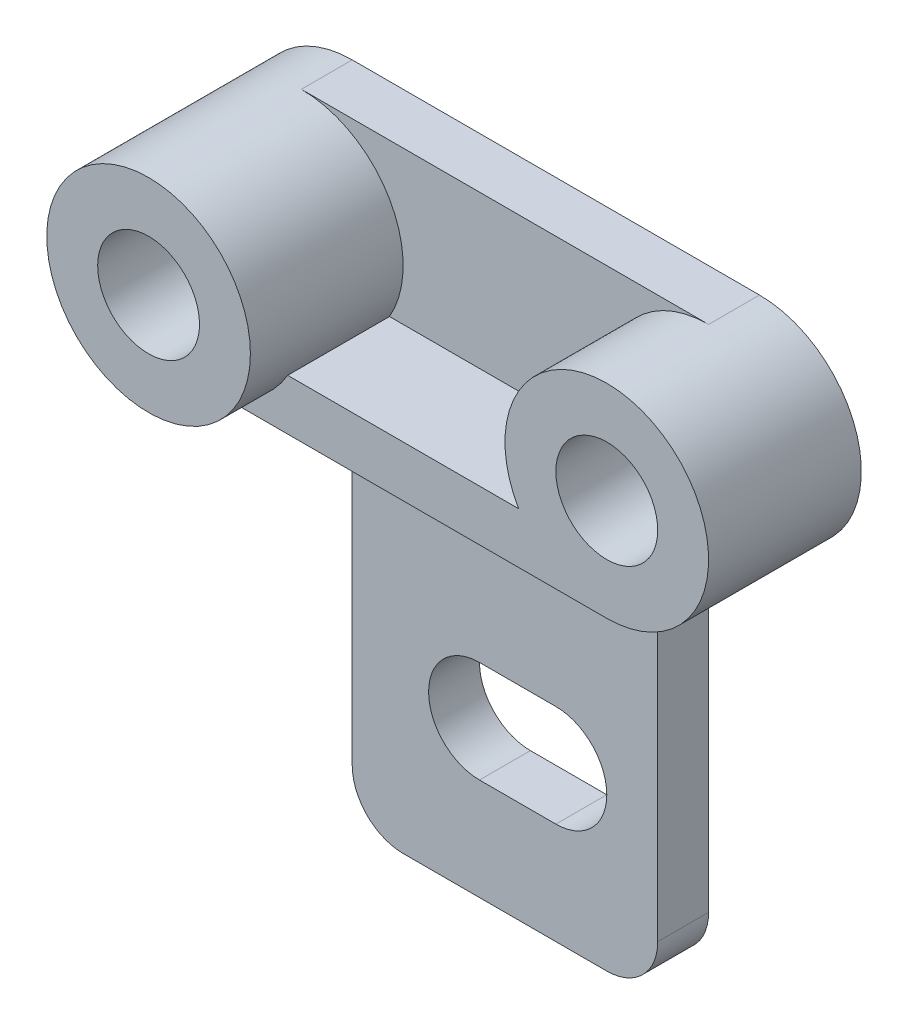
ISO-10303-21;
HEADER;
FILE_DESCRIPTION(('STEP AP214'),'2;1');
FILE_NAME('part.step','',(''),(''),'','','');
FILE_SCHEMA(('AUTOMOTIVE_DESIGN { 1 0 10303 214 1 1 1 1 }'));
ENDSEC;
DATA;
#1=APPLICATION_CONTEXT('core data for automotive mechanical design processes');
#2=APPLICATION_PROTOCOL_DEFINITION('international standard','automotive_design',2000,#1);
#3=PRODUCT_CONTEXT('',#1,'mechanical');
#4=PRODUCT('Part','Part','',(#3));
#5=PRODUCT_RELATED_PRODUCT_CATEGORY('part','',(#4));
#6=PRODUCT_DEFINITION_FORMATION('','',#4);
#7=PRODUCT_DEFINITION_CONTEXT('part definition',#1,'design');
#8=PRODUCT_DEFINITION('design','',#6,#7);
#9=PRODUCT_DEFINITION_SHAPE('','',#8);
#10=(LENGTH_UNIT() NAMED_UNIT(*) SI_UNIT(.MILLI.,.METRE.));
#11=(NAMED_UNIT(*) PLANE_ANGLE_UNIT() SI_UNIT($,.RADIAN.));
#12=(NAMED_UNIT(*) SI_UNIT($,.STERADIAN.) SOLID_ANGLE_UNIT());
#13=UNCERTAINTY_MEASURE_WITH_UNIT(LENGTH_MEASURE(1.E-05),#10,'distance_accuracy_value','');
#14=(GEOMETRIC_REPRESENTATION_CONTEXT(3) GLOBAL_UNCERTAINTY_ASSIGNED_CONTEXT((#13)) GLOBAL_UNIT_ASSIGNED_CONTEXT((#10,
#11,#12)) REPRESENTATION_CONTEXT('',''));
#15=CARTESIAN_POINT('',(0.,0.,0.));
#16=DIRECTION('',(0.,0.,1.));
#17=DIRECTION('',(1.,0.,0.));
#18=AXIS2_PLACEMENT_3D('',#15,#16,#17);
#19=CARTESIAN_POINT('',(-40.,3.00048960761197,40.));
#20=DIRECTION('',(0.,0.,1.));
#21=DIRECTION('',(1.,0.,0.));
#22=AXIS2_PLACEMENT_3D('',#19,#20,#21);
#23=PLANE('',#22);
#24=CARTESIAN_POINT('',(-40.,3.00048960761197,40.));
#25=DIRECTION('',(0.,0.,1.));
#26=DIRECTION('',(1.,0.,0.));
#27=AXIS2_PLACEMENT_3D('',#24,#25,#26);
#28=CIRCLE('',#27,20.);
#29=CARTESIAN_POINT('',(-20.,3.00048960761197,40.));
#30=VERTEX_POINT('',#29);
#31=EDGE_CURVE('E287',#30,#30,#28,.T.);
#32=ORIENTED_EDGE('',*,*,#31,.T.);
#33=EDGE_LOOP('',(#32));
#34=FACE_BOUND('',#33,.T.);
#35=CARTESIAN_POINT('',(-40.,3.00048960761197,40.));
#36=DIRECTION('',(0.,0.,-1.));
#37=DIRECTION('',(-1.,0.,0.));
#38=AXIS2_PLACEMENT_3D('',#35,#36,#37);
#39=CIRCLE('',#38,9.99999993899999);
#40=CARTESIAN_POINT('',(-49.999999939,3.00048960761197,40.));
#41=VERTEX_POINT('',#40);
#42=EDGE_CURVE('E187',#41,#41,#39,.T.);
#43=ORIENTED_EDGE('',*,*,#42,.T.);
#44=EDGE_LOOP('',(#43));
#45=FACE_BOUND('',#44,.T.);
#46=ADVANCED_FACE('F45',(#34,#45),#23,.T.);
#47=CARTESIAN_POINT('',(40.,3.00048960761197,0.));
#48=DIRECTION('',(0.,0.,1.));
#49=DIRECTION('',(1.,0.,0.));
#50=AXIS2_PLACEMENT_3D('',#47,#48,#49);
#51=PLANE('',#50);
#52=CARTESIAN_POINT('',(40.,3.00048960761197,0.));
#53=DIRECTION('',(0.,0.,-1.));
#54=DIRECTION('',(-1.,0.,0.));
#55=AXIS2_PLACEMENT_3D('',#52,#53,#54);
#56=CIRCLE('',#55,9.999999939);
#57=CARTESIAN_POINT('',(30.000000061,3.00048960761197,0.));
#58=VERTEX_POINT('',#57);
#59=EDGE_CURVE('E429',#58,#58,#56,.T.);
#60=ORIENTED_EDGE('',*,*,#59,.F.);
#61=EDGE_LOOP('',(#60));
#62=FACE_BOUND('',#61,.T.);
#63=DIRECTION('',(-1.,0.,0.));
#64=VECTOR('',#63,1.);
#65=CARTESIAN_POINT('',(-4.99999999999999,-56.999510392388,0.));
#66=LINE('',#65,#64);
#67=CARTESIAN_POINT('',(10.,-56.999510392388,0.));
#68=VERTEX_POINT('',#67);
#69=CARTESIAN_POINT('',(-4.99999999999999,-56.999510392388,0.));
#70=VERTEX_POINT('',#69);
#71=EDGE_CURVE('E168',#68,#70,#66,.T.);
#72=ORIENTED_EDGE('',*,*,#71,.T.);
#73=CARTESIAN_POINT('',(-4.99999999999999,-66.999510392388,0.));
#74=DIRECTION('',(0.,0.,1.));
#75=DIRECTION('',(1.,0.,0.));
#76=AXIS2_PLACEMENT_3D('',#73,#74,#75);
#77=CIRCLE('',#76,10.);
#78=CARTESIAN_POINT('',(-4.99999999999999,-76.999510392388,0.));
#79=VERTEX_POINT('',#78);
#80=EDGE_CURVE('E161',#70,#79,#77,.T.);
#81=ORIENTED_EDGE('',*,*,#80,.T.);
#82=DIRECTION('',(1.,0.,0.));
#83=VECTOR('',#82,1.);
#84=CARTESIAN_POINT('',(-4.99999999999999,-76.999510392388,0.));
#85=LINE('',#84,#83);
#86=CARTESIAN_POINT('',(10.,-76.999510392388,0.));
#87=VERTEX_POINT('',#86);
#88=EDGE_CURVE('E171',#79,#87,#85,.T.);
#89=ORIENTED_EDGE('',*,*,#88,.T.);
#90=CARTESIAN_POINT('',(10.,-66.999510392388,0.));
#91=DIRECTION('',(0.,0.,1.));
#92=DIRECTION('',(1.,0.,0.));
#93=AXIS2_PLACEMENT_3D('',#90,#91,#92);
#94=CIRCLE('',#93,10.);
#95=EDGE_CURVE('E61',#87,#68,#94,.T.);
#96=ORIENTED_EDGE('',*,*,#95,.T.);
#97=EDGE_LOOP('',(#72,#81,#89,#96));
#98=FACE_BOUND('',#97,.T.);
#99=DIRECTION('',(-1.,0.,0.));
#100=VECTOR('',#99,1.);
#101=CARTESIAN_POINT('',(40.,-16.999510392388,0.));
#102=LINE('',#101,#100);
#103=CARTESIAN_POINT('',(40.,-16.999510392388,0.));
#104=VERTEX_POINT('',#103);
#105=CARTESIAN_POINT('',(30.,-16.999510392388,0.));
#106=VERTEX_POINT('',#105);
#107=EDGE_CURVE('E301',#104,#106,#102,.T.);
#108=ORIENTED_EDGE('',*,*,#107,.T.);
#109=DIRECTION('',(0.,1.,0.));
#110=VECTOR('',#109,1.);
#111=CARTESIAN_POINT('',(30.,-16.999510392388,0.));
#112=LINE('',#111,#110);
#113=CARTESIAN_POINT('',(30.,-86.999510392388,0.));
#114=VERTEX_POINT('',#113);
#115=EDGE_CURVE('E228',#114,#106,#112,.T.);
#116=ORIENTED_EDGE('',*,*,#115,.F.);
#117=CARTESIAN_POINT('',(20.,-86.999510392388,0.));
#118=DIRECTION('',(0.,0.,1.));
#119=DIRECTION('',(1.,0.,0.));
#120=AXIS2_PLACEMENT_3D('',#117,#118,#119);
#121=CIRCLE('',#120,9.99999999999999);
#122=CARTESIAN_POINT('',(19.9999999999999,-96.999510392388,0.));
#123=VERTEX_POINT('',#122);
#124=EDGE_CURVE('E224',#123,#114,#121,.T.);
#125=ORIENTED_EDGE('',*,*,#124,.F.);
#126=DIRECTION('',(1.,0.,0.));
#127=VECTOR('',#126,1.);
#128=CARTESIAN_POINT('',(-19.9999999999999,-96.999510392388,0.));
#129=LINE('',#128,#127);
#130=CARTESIAN_POINT('',(-19.9999999999999,-96.999510392388,0.));
#131=VERTEX_POINT('',#130);
#132=EDGE_CURVE('E220',#131,#123,#129,.T.);
#133=ORIENTED_EDGE('',*,*,#132,.F.);
#134=CARTESIAN_POINT('',(-20.,-86.999510392388,0.));
#135=DIRECTION('',(0.,0.,1.));
#136=DIRECTION('',(1.,0.,0.));
#137=AXIS2_PLACEMENT_3D('',#134,#135,#136);
#138=CIRCLE('',#137,10.);
#139=CARTESIAN_POINT('',(-30.,-86.999510392388,0.));
#140=VERTEX_POINT('',#139);
#141=EDGE_CURVE('E215',#140,#131,#138,.T.);
#142=ORIENTED_EDGE('',*,*,#141,.F.);
#143=DIRECTION('',(0.,-1.,0.));
#144=VECTOR('',#143,1.);
#145=CARTESIAN_POINT('',(-30.,-16.999510392388,0.));
#146=LINE('',#145,#144);
#147=CARTESIAN_POINT('',(-30.,-16.999510392388,0.));
#148=VERTEX_POINT('',#147);
#149=EDGE_CURVE('E211',#148,#140,#146,.T.);
#150=ORIENTED_EDGE('',*,*,#149,.F.);
#151=CARTESIAN_POINT('',(-40.,-16.999510392388,0.));
#152=VERTEX_POINT('',#151);
#153=EDGE_CURVE('E291',#148,#152,#102,.T.);
#154=ORIENTED_EDGE('',*,*,#153,.T.);
#155=CARTESIAN_POINT('',(-40.,3.00048960761197,0.));
#156=DIRECTION('',(0.,0.,1.));
#157=DIRECTION('',(1.,0.,0.));
#158=AXIS2_PLACEMENT_3D('',#155,#156,#157);
#159=CIRCLE('',#158,20.);
#160=CARTESIAN_POINT('',(-40.,23.000489607612,0.));
#161=VERTEX_POINT('',#160);
#162=EDGE_CURVE('E286',#161,#152,#159,.T.);
#163=ORIENTED_EDGE('',*,*,#162,.F.);
#164=DIRECTION('',(1.,0.,0.));
#165=VECTOR('',#164,1.);
#166=CARTESIAN_POINT('',(40.,23.000489607612,0.));
#167=LINE('',#166,#165);
#168=CARTESIAN_POINT('',(40.,23.000489607612,0.));
#169=VERTEX_POINT('',#168);
#170=EDGE_CURVE('E300',#161,#169,#167,.T.);
#171=ORIENTED_EDGE('',*,*,#170,.T.);
#172=CARTESIAN_POINT('',(40.,3.00048960761197,0.));
#173=DIRECTION('',(0.,0.,1.));
#174=DIRECTION('',(1.,0.,0.));
#175=AXIS2_PLACEMENT_3D('',#172,#173,#174);
#176=CIRCLE('',#175,20.);
#177=EDGE_CURVE('E312',#104,#169,#176,.T.);
#178=ORIENTED_EDGE('',*,*,#177,.F.);
#179=EDGE_LOOP('',(#108,#116,#125,#133,#142,#150,#154,#163,#171,#178));
#180=FACE_BOUND('',#179,.T.);
#181=CARTESIAN_POINT('',(-40.,3.00048960761197,0.));
#182=DIRECTION('',(0.,0.,-1.));
#183=DIRECTION('',(-1.,0.,0.));
#184=AXIS2_PLACEMENT_3D('',#181,#182,#183);
#185=CIRCLE('',#184,9.999999939);
#186=CARTESIAN_POINT('',(-49.999999939,3.00048960761197,0.));
#187=VERTEX_POINT('',#186);
#188=EDGE_CURVE('E428',#187,#187,#185,.T.);
#189=ORIENTED_EDGE('',*,*,#188,.F.);
#190=EDGE_LOOP('',(#189));
#191=FACE_BOUND('',#190,.T.);
#192=ADVANCED_FACE('F176',(#62,#98,#180,#191),#51,.F.);
#193=CARTESIAN_POINT('',(40.,3.00048960761197,30.));
#194=DIRECTION('',(0.,0.,-1.));
#195=DIRECTION('',(-1.,0.,0.));
#196=AXIS2_PLACEMENT_3D('',#193,#194,#195);
#197=CYLINDRICAL_SURFACE('',#196,20.);
#198=DIRECTION('',(0.,0.,-1.));
#199=VECTOR('',#198,1.);
#200=CARTESIAN_POINT('',(22.6794919243112,-6.99951039238803,30.));
#201=LINE('',#200,#199);
#202=CARTESIAN_POINT('',(22.6794919243112,-6.99951039238803,30.));
#203=VERTEX_POINT('',#202);
#204=CARTESIAN_POINT('',(22.6794919243112,-6.99951039238803,10.));
#205=VERTEX_POINT('',#204);
#206=EDGE_CURVE('E281',#203,#205,#201,.T.);
#207=ORIENTED_EDGE('',*,*,#206,.F.);
#208=CARTESIAN_POINT('',(40.,3.00048960761197,30.));
#209=DIRECTION('',(0.,0.,1.));
#210=DIRECTION('',(1.,0.,0.));
#211=AXIS2_PLACEMENT_3D('',#208,#209,#210);
#212=CIRCLE('',#211,20.);
#213=CARTESIAN_POINT('',(40.,-16.999510392388,30.));
#214=VERTEX_POINT('',#213);
#215=EDGE_CURVE('E324',#214,#203,#212,.T.);
#216=ORIENTED_EDGE('',*,*,#215,.F.);
#217=DIRECTION('',(0.,0.,-1.));
#218=VECTOR('',#217,1.);
#219=CARTESIAN_POINT('',(40.,-16.999510392388,10.));
#220=LINE('',#219,#218);
#221=EDGE_CURVE('E299',#214,#104,#220,.T.);
#222=ORIENTED_EDGE('',*,*,#221,.T.);
#223=ORIENTED_EDGE('',*,*,#177,.T.);
#224=DIRECTION('',(0.,0.,-1.));
#225=VECTOR('',#224,1.);
#226=CARTESIAN_POINT('',(40.,23.000489607612,10.));
#227=LINE('',#226,#225);
#228=CARTESIAN_POINT('',(40.,23.000489607612,10.));
#229=VERTEX_POINT('',#228);
#230=EDGE_CURVE('E308',#229,#169,#227,.T.);
#231=ORIENTED_EDGE('',*,*,#230,.F.);
#232=CARTESIAN_POINT('',(40.,3.00048960761197,10.));
#233=DIRECTION('',(0.,0.,-1.));
#234=DIRECTION('',(-1.,0.,0.));
#235=AXIS2_PLACEMENT_3D('',#232,#233,#234);
#236=CIRCLE('',#235,20.);
#237=EDGE_CURVE('E328',#205,#229,#236,.T.);
#238=ORIENTED_EDGE('',*,*,#237,.F.);
#239=EDGE_LOOP('',(#207,#216,#222,#223,#231,#238));
#240=FACE_BOUND('',#239,.T.);
#241=ADVANCED_FACE('F47',(#240),#197,.T.);
#242=CARTESIAN_POINT('',(0.,0.,10.));
#243=DIRECTION('',(0.,0.,-1.));
#244=DIRECTION('',(-1.,0.,0.));
#245=AXIS2_PLACEMENT_3D('',#242,#243,#244);
#246=PLANE('',#245);
#247=DIRECTION('',(-1.,0.,0.));
#248=VECTOR('',#247,1.);
#249=CARTESIAN_POINT('',(40.,-6.99951039238803,10.));
#250=LINE('',#249,#248);
#251=CARTESIAN_POINT('',(-22.6794919243112,-6.99951039238803,10.));
#252=VERTEX_POINT('',#251);
#253=EDGE_CURVE('E258',#205,#252,#250,.T.);
#254=ORIENTED_EDGE('',*,*,#253,.F.);
#255=ORIENTED_EDGE('',*,*,#237,.T.);
#256=DIRECTION('',(1.,0.,0.));
#257=VECTOR('',#256,1.);
#258=CARTESIAN_POINT('',(40.,23.000489607612,10.));
#259=LINE('',#258,#257);
#260=CARTESIAN_POINT('',(-40.,23.000489607612,10.));
#261=VERTEX_POINT('',#260);
#262=EDGE_CURVE('E295',#261,#229,#259,.T.);
#263=ORIENTED_EDGE('',*,*,#262,.F.);
#264=CARTESIAN_POINT('',(-40.,3.00048960761197,10.));
#265=DIRECTION('',(0.,0.,-1.));
#266=DIRECTION('',(-1.,0.,0.));
#267=AXIS2_PLACEMENT_3D('',#264,#265,#266);
#268=CIRCLE('',#267,20.);
#269=EDGE_CURVE('E333',#252,#261,#268,.F.);
#270=ORIENTED_EDGE('',*,*,#269,.F.);
#271=EDGE_LOOP('',(#254,#255,#263,#270));
#272=FACE_BOUND('',#271,.T.);
#273=ADVANCED_FACE('F357',(#272),#246,.F.);
#274=CARTESIAN_POINT('',(-40.,3.00048960761197,40.));
#275=DIRECTION('',(0.,0.,-1.));
#276=DIRECTION('',(-1.,0.,0.));
#277=AXIS2_PLACEMENT_3D('',#274,#275,#276);
#278=CYLINDRICAL_SURFACE('',#277,20.);
#279=ORIENTED_EDGE('',*,*,#31,.F.);
#280=EDGE_LOOP('',(#279));
#281=FACE_BOUND('',#280,.T.);
#282=DIRECTION('',(0.,0.,-1.));
#283=VECTOR('',#282,1.);
#284=CARTESIAN_POINT('',(-22.6794919243112,-6.99951039238803,40.));
#285=LINE('',#284,#283);
#286=CARTESIAN_POINT('',(-22.6794919243112,-6.99951039238803,30.));
#287=VERTEX_POINT('',#286);
#288=EDGE_CURVE('E11',#252,#287,#285,.F.);
#289=ORIENTED_EDGE('',*,*,#288,.F.);
#290=ORIENTED_EDGE('',*,*,#269,.T.);
#291=DIRECTION('',(0.,0.,-1.));
#292=VECTOR('',#291,1.);
#293=CARTESIAN_POINT('',(-40.,23.000489607612,10.));
#294=LINE('',#293,#292);
#295=EDGE_CURVE('E313',#261,#161,#294,.T.);
#296=ORIENTED_EDGE('',*,*,#295,.T.);
#297=ORIENTED_EDGE('',*,*,#162,.T.);
#298=DIRECTION('',(0.,0.,-1.));
#299=VECTOR('',#298,1.);
#300=CARTESIAN_POINT('',(-40.,-16.999510392388,10.));
#301=LINE('',#300,#299);
#302=CARTESIAN_POINT('',(-40.,-16.999510392388,30.));
#303=VERTEX_POINT('',#302);
#304=EDGE_CURVE('E317',#303,#152,#301,.T.);
#305=ORIENTED_EDGE('',*,*,#304,.F.);
#306=CARTESIAN_POINT('',(-40.,3.00048960761197,30.));
#307=DIRECTION('',(0.,0.,1.));
#308=DIRECTION('',(1.,0.,0.));
#309=AXIS2_PLACEMENT_3D('',#306,#307,#308);
#310=CIRCLE('',#309,20.);
#311=EDGE_CURVE('E54',#303,#287,#310,.T.);
#312=ORIENTED_EDGE('',*,*,#311,.T.);
#313=EDGE_LOOP('',(#289,#290,#296,#297,#305,#312));
#314=FACE_BOUND('',#313,.T.);
#315=ADVANCED_FACE('F340',(#281,#314),#278,.T.);
#316=CARTESIAN_POINT('',(40.,3.00048960761197,30.));
#317=DIRECTION('',(0.,0.,1.));
#318=DIRECTION('',(1.,0.,0.));
#319=AXIS2_PLACEMENT_3D('',#316,#317,#318);
#320=PLANE('',#319);
#321=CARTESIAN_POINT('',(40.,3.00048960761197,30.));
#322=DIRECTION('',(0.,0.,1.));
#323=DIRECTION('',(1.,0.,0.));
#324=AXIS2_PLACEMENT_3D('',#321,#322,#323);
#325=CIRCLE('',#324,9.99999993899999);
#326=CARTESIAN_POINT('',(49.999999939,3.00048960761197,30.));
#327=VERTEX_POINT('',#326);
#328=EDGE_CURVE('E425',#327,#327,#325,.T.);
#329=ORIENTED_EDGE('',*,*,#328,.F.);
#330=EDGE_LOOP('',(#329));
#331=FACE_BOUND('',#330,.T.);
#332=ORIENTED_EDGE('',*,*,#215,.T.);
#333=DIRECTION('',(-1.,0.,0.));
#334=VECTOR('',#333,1.);
#335=CARTESIAN_POINT('',(40.,-6.99951039238803,30.));
#336=LINE('',#335,#334);
#337=EDGE_CURVE('E274',#203,#287,#336,.T.);
#338=ORIENTED_EDGE('',*,*,#337,.T.);
#339=ORIENTED_EDGE('',*,*,#311,.F.);
#340=DIRECTION('',(1.,0.,0.));
#341=VECTOR('',#340,1.);
#342=CARTESIAN_POINT('',(40.,-16.999510392388,30.));
#343=LINE('',#342,#341);
#344=EDGE_CURVE('E277',#303,#214,#343,.T.);
#345=ORIENTED_EDGE('',*,*,#344,.T.);
#346=EDGE_LOOP('',(#332,#338,#339,#345));
#347=FACE_BOUND('',#346,.T.);
#348=ADVANCED_FACE('F344',(#331,#347),#320,.T.);
#349=CARTESIAN_POINT('',(40.,23.000489607612,10.));
#350=DIRECTION('',(0.,1.,0.));
#351=DIRECTION('',(0.,0.,1.));
#352=AXIS2_PLACEMENT_3D('',#349,#350,#351);
#353=PLANE('',#352);
#354=ORIENTED_EDGE('',*,*,#170,.F.);
#355=ORIENTED_EDGE('',*,*,#295,.F.);
#356=ORIENTED_EDGE('',*,*,#262,.T.);
#357=ORIENTED_EDGE('',*,*,#230,.T.);
#358=EDGE_LOOP('',(#354,#355,#356,#357));
#359=FACE_BOUND('',#358,.T.);
#360=ADVANCED_FACE('F413',(#359),#353,.T.);
#361=CARTESIAN_POINT('',(40.,-16.999510392388,10.));
#362=DIRECTION('',(0.,-1.,0.));
#363=DIRECTION('',(0.,0.,-1.));
#364=AXIS2_PLACEMENT_3D('',#361,#362,#363);
#365=PLANE('',#364);
#366=DIRECTION('',(0.,0.,1.));
#367=VECTOR('',#366,1.);
#368=CARTESIAN_POINT('',(-30.,-16.999510392388,0.));
#369=LINE('',#368,#367);
#370=CARTESIAN_POINT('',(-30.,-16.999510392388,10.));
#371=VERTEX_POINT('',#370);
#372=EDGE_CURVE('E255',#148,#371,#369,.T.);
#373=ORIENTED_EDGE('',*,*,#372,.T.);
#374=DIRECTION('',(-1.,0.,0.));
#375=VECTOR('',#374,1.);
#376=CARTESIAN_POINT('',(-30.,-16.999510392388,10.));
#377=LINE('',#376,#375);
#378=CARTESIAN_POINT('',(30.,-16.999510392388,10.));
#379=VERTEX_POINT('',#378);
#380=EDGE_CURVE('E216',#379,#371,#377,.T.);
#381=ORIENTED_EDGE('',*,*,#380,.F.);
#382=DIRECTION('',(0.,0.,1.));
#383=VECTOR('',#382,1.);
#384=CARTESIAN_POINT('',(30.,-16.999510392388,0.));
#385=LINE('',#384,#383);
#386=EDGE_CURVE('E259',#106,#379,#385,.T.);
#387=ORIENTED_EDGE('',*,*,#386,.F.);
#388=ORIENTED_EDGE('',*,*,#107,.F.);
#389=ORIENTED_EDGE('',*,*,#221,.F.);
#390=ORIENTED_EDGE('',*,*,#344,.F.);
#391=ORIENTED_EDGE('',*,*,#304,.T.);
#392=ORIENTED_EDGE('',*,*,#153,.F.);
#393=EDGE_LOOP('',(#373,#381,#387,#388,#389,#390,#391,#392));
#394=FACE_BOUND('',#393,.T.);
#395=ADVANCED_FACE('F347',(#394),#365,.T.);
#396=CARTESIAN_POINT('',(40.,-6.99951039238803,30.));
#397=DIRECTION('',(0.,-1.,0.));
#398=DIRECTION('',(1.,0.,0.));
#399=AXIS2_PLACEMENT_3D('',#396,#397,#398);
#400=PLANE('',#399);
#401=ORIENTED_EDGE('',*,*,#337,.F.);
#402=ORIENTED_EDGE('',*,*,#206,.T.);
#403=ORIENTED_EDGE('',*,*,#253,.T.);
#404=ORIENTED_EDGE('',*,*,#288,.T.);
#405=EDGE_LOOP('',(#401,#402,#403,#404));
#406=FACE_BOUND('',#405,.T.);
#407=ADVANCED_FACE('F355',(#406),#400,.F.);
#408=CARTESIAN_POINT('',(-30.,-16.999510392388,0.));
#409=DIRECTION('',(-1.,0.,0.));
#410=DIRECTION('',(0.,-1.,0.));
#411=AXIS2_PLACEMENT_3D('',#408,#409,#410);
#412=PLANE('',#411);
#413=DIRECTION('',(0.,-1.,0.));
#414=VECTOR('',#413,1.);
#415=CARTESIAN_POINT('',(-30.,-16.999510392388,10.));
#416=LINE('',#415,#414);
#417=CARTESIAN_POINT('',(-30.,-86.999510392388,10.));
#418=VERTEX_POINT('',#417);
#419=EDGE_CURVE('E205',#371,#418,#416,.T.);
#420=ORIENTED_EDGE('',*,*,#419,.F.);
#421=ORIENTED_EDGE('',*,*,#372,.F.);
#422=ORIENTED_EDGE('',*,*,#149,.T.);
#423=DIRECTION('',(0.,0.,1.));
#424=VECTOR('',#423,1.);
#425=CARTESIAN_POINT('',(-30.,-86.999510392388,0.));
#426=LINE('',#425,#424);
#427=EDGE_CURVE('E232',#140,#418,#426,.T.);
#428=ORIENTED_EDGE('',*,*,#427,.T.);
#429=EDGE_LOOP('',(#420,#421,#422,#428));
#430=FACE_BOUND('',#429,.T.);
#431=ADVANCED_FACE('F369',(#430),#412,.T.);
#432=CARTESIAN_POINT('',(30.,-16.999510392388,0.));
#433=DIRECTION('',(1.,0.,0.));
#434=DIRECTION('',(0.,1.,0.));
#435=AXIS2_PLACEMENT_3D('',#432,#433,#434);
#436=PLANE('',#435);
#437=DIRECTION('',(0.,1.,0.));
#438=VECTOR('',#437,1.);
#439=CARTESIAN_POINT('',(30.,-16.999510392388,10.));
#440=LINE('',#439,#438);
#441=CARTESIAN_POINT('',(30.,-86.999510392388,10.));
#442=VERTEX_POINT('',#441);
#443=EDGE_CURVE('E248',#442,#379,#440,.T.);
#444=ORIENTED_EDGE('',*,*,#443,.F.);
#445=DIRECTION('',(0.,0.,1.));
#446=VECTOR('',#445,1.);
#447=CARTESIAN_POINT('',(30.,-86.999510392388,0.));
#448=LINE('',#447,#446);
#449=EDGE_CURVE('E263',#114,#442,#448,.T.);
#450=ORIENTED_EDGE('',*,*,#449,.F.);
#451=ORIENTED_EDGE('',*,*,#115,.T.);
#452=ORIENTED_EDGE('',*,*,#386,.T.);
#453=EDGE_LOOP('',(#444,#450,#451,#452));
#454=FACE_BOUND('',#453,.T.);
#455=ADVANCED_FACE('F375',(#454),#436,.T.);
#456=CARTESIAN_POINT('',(20.,-86.999510392388,0.));
#457=DIRECTION('',(0.,0.,1.));
#458=DIRECTION('',(1.,0.,0.));
#459=AXIS2_PLACEMENT_3D('',#456,#457,#458);
#460=CYLINDRICAL_SURFACE('',#459,9.99999999999999);
#461=CARTESIAN_POINT('',(20.,-86.999510392388,10.));
#462=DIRECTION('',(0.,0.,1.));
#463=DIRECTION('',(1.,0.,0.));
#464=AXIS2_PLACEMENT_3D('',#461,#462,#463);
#465=CIRCLE('',#464,9.99999999999999);
#466=CARTESIAN_POINT('',(19.9999999999999,-96.999510392388,10.));
#467=VERTEX_POINT('',#466);
#468=EDGE_CURVE('E244',#467,#442,#465,.T.);
#469=ORIENTED_EDGE('',*,*,#468,.F.);
#470=DIRECTION('',(0.,0.,1.));
#471=VECTOR('',#470,1.);
#472=CARTESIAN_POINT('',(19.9999999999999,-96.999510392388,0.));
#473=LINE('',#472,#471);
#474=EDGE_CURVE('E266',#123,#467,#473,.T.);
#475=ORIENTED_EDGE('',*,*,#474,.F.);
#476=ORIENTED_EDGE('',*,*,#124,.T.);
#477=ORIENTED_EDGE('',*,*,#449,.T.);
#478=EDGE_LOOP('',(#469,#475,#476,#477));
#479=FACE_BOUND('',#478,.T.);
#480=ADVANCED_FACE('F381',(#479),#460,.T.);
#481=CARTESIAN_POINT('',(-19.9999999999999,-96.999510392388,0.));
#482=DIRECTION('',(0.,-1.,0.));
#483=DIRECTION('',(0.,0.,-1.));
#484=AXIS2_PLACEMENT_3D('',#481,#482,#483);
#485=PLANE('',#484);
#486=DIRECTION('',(1.,0.,0.));
#487=VECTOR('',#486,1.);
#488=CARTESIAN_POINT('',(-19.9999999999999,-96.999510392388,10.));
#489=LINE('',#488,#487);
#490=CARTESIAN_POINT('',(-19.9999999999999,-96.999510392388,10.));
#491=VERTEX_POINT('',#490);
#492=EDGE_CURVE('E240',#491,#467,#489,.T.);
#493=ORIENTED_EDGE('',*,*,#492,.F.);
#494=DIRECTION('',(0.,0.,1.));
#495=VECTOR('',#494,1.);
#496=CARTESIAN_POINT('',(-19.9999999999999,-96.999510392388,0.));
#497=LINE('',#496,#495);
#498=EDGE_CURVE('E269',#131,#491,#497,.T.);
#499=ORIENTED_EDGE('',*,*,#498,.F.);
#500=ORIENTED_EDGE('',*,*,#132,.T.);
#501=ORIENTED_EDGE('',*,*,#474,.T.);
#502=EDGE_LOOP('',(#493,#499,#500,#501));
#503=FACE_BOUND('',#502,.T.);
#504=ADVANCED_FACE('F384',(#503),#485,.T.);
#505=CARTESIAN_POINT('',(-20.,-86.999510392388,0.));
#506=DIRECTION('',(0.,0.,1.));
#507=DIRECTION('',(1.,0.,0.));
#508=AXIS2_PLACEMENT_3D('',#505,#506,#507);
#509=CYLINDRICAL_SURFACE('',#508,10.);
#510=CARTESIAN_POINT('',(-20.,-86.999510392388,10.));
#511=DIRECTION('',(0.,0.,1.));
#512=DIRECTION('',(1.,0.,0.));
#513=AXIS2_PLACEMENT_3D('',#510,#511,#512);
#514=CIRCLE('',#513,10.);
#515=EDGE_CURVE('E236',#418,#491,#514,.T.);
#516=ORIENTED_EDGE('',*,*,#515,.F.);
#517=ORIENTED_EDGE('',*,*,#427,.F.);
#518=ORIENTED_EDGE('',*,*,#141,.T.);
#519=ORIENTED_EDGE('',*,*,#498,.T.);
#520=EDGE_LOOP('',(#516,#517,#518,#519));
#521=FACE_BOUND('',#520,.T.);
#522=ADVANCED_FACE('F386',(#521),#509,.T.);
#523=CARTESIAN_POINT('',(-20.,-86.999510392388,10.));
#524=DIRECTION('',(0.,0.,1.));
#525=DIRECTION('',(1.,0.,0.));
#526=AXIS2_PLACEMENT_3D('',#523,#524,#525);
#527=PLANE('',#526);
#528=CARTESIAN_POINT('',(-4.99999999999999,-66.999510392388,10.));
#529=DIRECTION('',(0.,0.,1.));
#530=DIRECTION('',(1.,0.,0.));
#531=AXIS2_PLACEMENT_3D('',#528,#529,#530);
#532=CIRCLE('',#531,10.);
#533=CARTESIAN_POINT('',(-4.99999999999999,-56.999510392388,10.));
#534=VERTEX_POINT('',#533);
#535=CARTESIAN_POINT('',(-4.99999999999999,-76.999510392388,10.));
#536=VERTEX_POINT('',#535);
#537=EDGE_CURVE('E69',#534,#536,#532,.T.);
#538=ORIENTED_EDGE('',*,*,#537,.F.);
#539=DIRECTION('',(-1.,0.,0.));
#540=VECTOR('',#539,1.);
#541=CARTESIAN_POINT('',(-4.99999999999999,-56.999510392388,10.));
#542=LINE('',#541,#540);
#543=CARTESIAN_POINT('',(10.,-56.999510392388,10.));
#544=VERTEX_POINT('',#543);
#545=EDGE_CURVE('E180',#544,#534,#542,.T.);
#546=ORIENTED_EDGE('',*,*,#545,.F.);
#547=CARTESIAN_POINT('',(10.,-66.999510392388,10.));
#548=DIRECTION('',(0.,0.,1.));
#549=DIRECTION('',(1.,0.,0.));
#550=AXIS2_PLACEMENT_3D('',#547,#548,#549);
#551=CIRCLE('',#550,10.);
#552=CARTESIAN_POINT('',(10.,-76.999510392388,10.));
#553=VERTEX_POINT('',#552);
#554=EDGE_CURVE('E184',#553,#544,#551,.T.);
#555=ORIENTED_EDGE('',*,*,#554,.F.);
#556=DIRECTION('',(1.,0.,0.));
#557=VECTOR('',#556,1.);
#558=CARTESIAN_POINT('',(-4.99999999999999,-76.999510392388,10.));
#559=LINE('',#558,#557);
#560=EDGE_CURVE('E196',#536,#553,#559,.T.);
#561=ORIENTED_EDGE('',*,*,#560,.F.);
#562=EDGE_LOOP('',(#538,#546,#555,#561));
#563=FACE_BOUND('',#562,.T.);
#564=ORIENTED_EDGE('',*,*,#419,.T.);
#565=ORIENTED_EDGE('',*,*,#515,.T.);
#566=ORIENTED_EDGE('',*,*,#492,.T.);
#567=ORIENTED_EDGE('',*,*,#468,.T.);
#568=ORIENTED_EDGE('',*,*,#443,.T.);
#569=ORIENTED_EDGE('',*,*,#380,.T.);
#570=EDGE_LOOP('',(#564,#565,#566,#567,#568,#569));
#571=FACE_BOUND('',#570,.T.);
#572=ADVANCED_FACE('F372',(#563,#571),#527,.T.);
#573=CARTESIAN_POINT('',(-4.99999999999999,-66.999510392388,0.));
#574=DIRECTION('',(0.,0.,1.));
#575=DIRECTION('',(1.,0.,0.));
#576=AXIS2_PLACEMENT_3D('',#573,#574,#575);
#577=CYLINDRICAL_SURFACE('',#576,10.);
#578=ORIENTED_EDGE('',*,*,#537,.T.);
#579=DIRECTION('',(0.,0.,1.));
#580=VECTOR('',#579,1.);
#581=CARTESIAN_POINT('',(-4.99999999999999,-76.999510392388,0.));
#582=LINE('',#581,#580);
#583=EDGE_CURVE('E157',#79,#536,#582,.T.);
#584=ORIENTED_EDGE('',*,*,#583,.F.);
#585=ORIENTED_EDGE('',*,*,#80,.F.);
#586=DIRECTION('',(0.,0.,1.));
#587=VECTOR('',#586,1.);
#588=CARTESIAN_POINT('',(-4.99999999999999,-56.999510392388,0.));
#589=LINE('',#588,#587);
#590=EDGE_CURVE('E202',#70,#534,#589,.T.);
#591=ORIENTED_EDGE('',*,*,#590,.T.);
#592=EDGE_LOOP('',(#578,#584,#585,#591));
#593=FACE_BOUND('',#592,.T.);
#594=ADVANCED_FACE('F159',(#593),#577,.F.);
#595=CARTESIAN_POINT('',(-4.99999999999999,-56.999510392388,0.));
#596=DIRECTION('',(0.,1.,0.));
#597=DIRECTION('',(0.,0.,1.));
#598=AXIS2_PLACEMENT_3D('',#595,#596,#597);
#599=PLANE('',#598);
#600=ORIENTED_EDGE('',*,*,#545,.T.);
#601=ORIENTED_EDGE('',*,*,#590,.F.);
#602=ORIENTED_EDGE('',*,*,#71,.F.);
#603=DIRECTION('',(0.,0.,1.));
#604=VECTOR('',#603,1.);
#605=CARTESIAN_POINT('',(10.,-56.999510392388,0.));
#606=LINE('',#605,#604);
#607=EDGE_CURVE('E206',#68,#544,#606,.T.);
#608=ORIENTED_EDGE('',*,*,#607,.T.);
#609=EDGE_LOOP('',(#600,#601,#602,#608));
#610=FACE_BOUND('',#609,.T.);
#611=ADVANCED_FACE('F447',(#610),#599,.F.);
#612=CARTESIAN_POINT('',(10.,-66.999510392388,0.));
#613=DIRECTION('',(0.,0.,1.));
#614=DIRECTION('',(1.,0.,0.));
#615=AXIS2_PLACEMENT_3D('',#612,#613,#614);
#616=CYLINDRICAL_SURFACE('',#615,10.);
#617=ORIENTED_EDGE('',*,*,#554,.T.);
#618=ORIENTED_EDGE('',*,*,#607,.F.);
#619=ORIENTED_EDGE('',*,*,#95,.F.);
#620=DIRECTION('',(0.,0.,1.));
#621=VECTOR('',#620,1.);
#622=CARTESIAN_POINT('',(10.,-76.999510392388,0.));
#623=LINE('',#622,#621);
#624=EDGE_CURVE('E167',#87,#553,#623,.T.);
#625=ORIENTED_EDGE('',*,*,#624,.T.);
#626=EDGE_LOOP('',(#617,#618,#619,#625));
#627=FACE_BOUND('',#626,.T.);
#628=ADVANCED_FACE('F450',(#627),#616,.F.);
#629=CARTESIAN_POINT('',(-4.99999999999999,-76.999510392388,0.));
#630=DIRECTION('',(0.,-1.,0.));
#631=DIRECTION('',(0.,0.,-1.));
#632=AXIS2_PLACEMENT_3D('',#629,#630,#631);
#633=PLANE('',#632);
#634=ORIENTED_EDGE('',*,*,#560,.T.);
#635=ORIENTED_EDGE('',*,*,#624,.F.);
#636=ORIENTED_EDGE('',*,*,#88,.F.);
#637=ORIENTED_EDGE('',*,*,#583,.T.);
#638=EDGE_LOOP('',(#634,#635,#636,#637));
#639=FACE_BOUND('',#638,.T.);
#640=ADVANCED_FACE('F172',(#639),#633,.F.);
#641=CARTESIAN_POINT('',(-40.,3.00048960761197,0.));
#642=DIRECTION('',(0.,0.,-1.));
#643=DIRECTION('',(-1.,0.,0.));
#644=AXIS2_PLACEMENT_3D('',#641,#642,#643);
#645=CYLINDRICAL_SURFACE('',#644,9.99999993899999);
#646=ORIENTED_EDGE('',*,*,#42,.F.);
#647=EDGE_LOOP('',(#646));
#648=FACE_BOUND('',#647,.T.);
#649=ORIENTED_EDGE('',*,*,#188,.T.);
#650=EDGE_LOOP('',(#649));
#651=FACE_BOUND('',#650,.T.);
#652=ADVANCED_FACE('F440',(#648,#651),#645,.F.);
#653=CARTESIAN_POINT('',(40.,3.00048960761197,0.));
#654=DIRECTION('',(0.,0.,-1.));
#655=DIRECTION('',(-1.,0.,0.));
#656=AXIS2_PLACEMENT_3D('',#653,#654,#655);
#657=CYLINDRICAL_SURFACE('',#656,9.99999993899999);
#658=ORIENTED_EDGE('',*,*,#328,.T.);
#659=EDGE_LOOP('',(#658));
#660=FACE_BOUND('',#659,.T.);
#661=ORIENTED_EDGE('',*,*,#59,.T.);
#662=EDGE_LOOP('',(#661));
#663=FACE_BOUND('',#662,.T.);
#664=ADVANCED_FACE('F438',(#660,#663),#657,.F.);
#665=CLOSED_SHELL('',(#46,#192,#241,#273,#315,#348,#360,#395,#407,#431,#455,#480,#504,#522,#572,
#594,#611,#628,#640,#652,#664));
#666=MANIFOLD_SOLID_BREP('B2',#665);
#667=ADVANCED_BREP_SHAPE_REPRESENTATION('',(#18,#666),#14);
#668=SHAPE_DEFINITION_REPRESENTATION(#9,#667);
ENDSEC;
END-ISO-10303-21;
